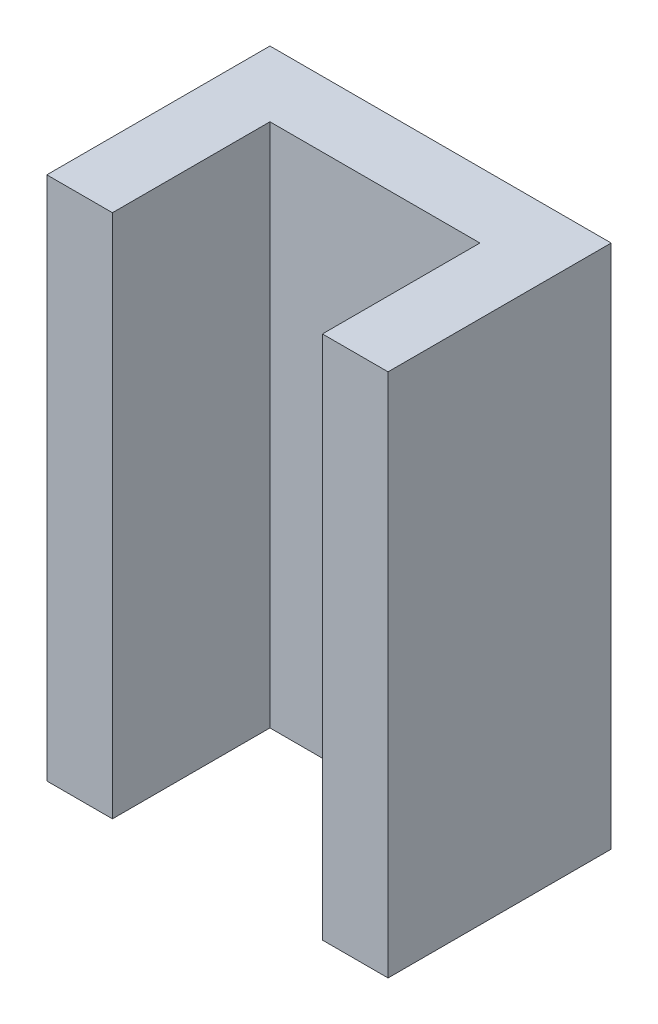
ISO-10303-21;
HEADER;
FILE_DESCRIPTION(('STEP AP214'),'2;1');
FILE_NAME('part.step','',(''),(''),'','','');
FILE_SCHEMA(('AUTOMOTIVE_DESIGN { 1 0 10303 214 1 1 1 1 }'));
ENDSEC;
DATA;
#1=APPLICATION_CONTEXT('core data for automotive mechanical design processes');
#2=APPLICATION_PROTOCOL_DEFINITION('international standard','automotive_design',2000,#1);
#3=PRODUCT_CONTEXT('',#1,'mechanical');
#4=PRODUCT('Part','Part','',(#3));
#5=PRODUCT_RELATED_PRODUCT_CATEGORY('part','',(#4));
#6=PRODUCT_DEFINITION_FORMATION('','',#4);
#7=PRODUCT_DEFINITION_CONTEXT('part definition',#1,'design');
#8=PRODUCT_DEFINITION('design','',#6,#7);
#9=PRODUCT_DEFINITION_SHAPE('','',#8);
#10=(LENGTH_UNIT() NAMED_UNIT(*) SI_UNIT(.MILLI.,.METRE.));
#11=(NAMED_UNIT(*) PLANE_ANGLE_UNIT() SI_UNIT($,.RADIAN.));
#12=(NAMED_UNIT(*) SI_UNIT($,.STERADIAN.) SOLID_ANGLE_UNIT());
#13=UNCERTAINTY_MEASURE_WITH_UNIT(LENGTH_MEASURE(1.E-05),#10,'distance_accuracy_value','');
#14=(GEOMETRIC_REPRESENTATION_CONTEXT(3) GLOBAL_UNCERTAINTY_ASSIGNED_CONTEXT((#13)) GLOBAL_UNIT_ASSIGNED_CONTEXT((#10,
#11,#12)) REPRESENTATION_CONTEXT('',''));
#15=CARTESIAN_POINT('',(0.,0.,0.));
#16=DIRECTION('',(0.,0.,1.));
#17=DIRECTION('',(1.,0.,0.));
#18=AXIS2_PLACEMENT_3D('',#15,#16,#17);
#19=CARTESIAN_POINT('',(0.,20.,0.));
#20=DIRECTION('',(0.,0.,-1.));
#21=DIRECTION('',(-1.,0.,0.));
#22=AXIS2_PLACEMENT_3D('',#19,#20,#21);
#23=PLANE('',#22);
#24=DIRECTION('',(1.,0.,0.));
#25=VECTOR('',#24,1.);
#26=CARTESIAN_POINT('',(0.,0.,0.));
#27=LINE('',#26,#25);
#28=CARTESIAN_POINT('',(0.,0.,0.));
#29=VERTEX_POINT('',#28);
#30=CARTESIAN_POINT('',(2.5,0.,0.));
#31=VERTEX_POINT('',#30);
#32=EDGE_CURVE('E129',#29,#31,#27,.T.);
#33=ORIENTED_EDGE('',*,*,#32,.T.);
#34=DIRECTION('',(0.,-1.,0.));
#35=VECTOR('',#34,1.);
#36=CARTESIAN_POINT('',(2.5,20.,0.));
#37=LINE('',#36,#35);
#38=CARTESIAN_POINT('',(2.5,20.,0.));
#39=VERTEX_POINT('',#38);
#40=EDGE_CURVE('E11',#39,#31,#37,.T.);
#41=ORIENTED_EDGE('',*,*,#40,.F.);
#42=DIRECTION('',(1.,0.,0.));
#43=VECTOR('',#42,1.);
#44=CARTESIAN_POINT('',(0.,20.,0.));
#45=LINE('',#44,#43);
#46=CARTESIAN_POINT('',(0.,20.,0.));
#47=VERTEX_POINT('',#46);
#48=EDGE_CURVE('E143',#47,#39,#45,.T.);
#49=ORIENTED_EDGE('',*,*,#48,.F.);
#50=DIRECTION('',(0.,-1.,0.));
#51=VECTOR('',#50,1.);
#52=CARTESIAN_POINT('',(0.,20.,0.));
#53=LINE('',#52,#51);
#54=EDGE_CURVE('E125',#47,#29,#53,.T.);
#55=ORIENTED_EDGE('',*,*,#54,.T.);
#56=EDGE_LOOP('',(#33,#41,#49,#55));
#57=FACE_BOUND('',#56,.T.);
#58=ADVANCED_FACE('F33',(#57),#23,.F.);
#59=CARTESIAN_POINT('',(2.5,20.,0.));
#60=DIRECTION('',(-1.,0.,0.));
#61=DIRECTION('',(0.,0.,1.));
#62=AXIS2_PLACEMENT_3D('',#59,#60,#61);
#63=PLANE('',#62);
#64=DIRECTION('',(0.,0.,-1.));
#65=VECTOR('',#64,1.);
#66=CARTESIAN_POINT('',(2.5,0.,0.));
#67=LINE('',#66,#65);
#68=CARTESIAN_POINT('',(2.5,0.,-6.));
#69=VERTEX_POINT('',#68);
#70=EDGE_CURVE('E132',#31,#69,#67,.T.);
#71=ORIENTED_EDGE('',*,*,#70,.T.);
#72=DIRECTION('',(0.,-1.,0.));
#73=VECTOR('',#72,1.);
#74=CARTESIAN_POINT('',(2.5,20.,-6.));
#75=LINE('',#74,#73);
#76=CARTESIAN_POINT('',(2.5,20.,-6.));
#77=VERTEX_POINT('',#76);
#78=EDGE_CURVE('E41',#77,#69,#75,.T.);
#79=ORIENTED_EDGE('',*,*,#78,.F.);
#80=DIRECTION('',(0.,0.,-1.));
#81=VECTOR('',#80,1.);
#82=CARTESIAN_POINT('',(2.5,20.,0.));
#83=LINE('',#82,#81);
#84=EDGE_CURVE('E92',#39,#77,#83,.T.);
#85=ORIENTED_EDGE('',*,*,#84,.F.);
#86=ORIENTED_EDGE('',*,*,#40,.T.);
#87=EDGE_LOOP('',(#71,#79,#85,#86));
#88=FACE_BOUND('',#87,.T.);
#89=ADVANCED_FACE('F178',(#88),#63,.F.);
#90=CARTESIAN_POINT('',(2.5,20.,-6.));
#91=DIRECTION('',(0.,0.,-1.));
#92=DIRECTION('',(-1.,0.,0.));
#93=AXIS2_PLACEMENT_3D('',#90,#91,#92);
#94=PLANE('',#93);
#95=DIRECTION('',(1.,0.,0.));
#96=VECTOR('',#95,1.);
#97=CARTESIAN_POINT('',(2.5,0.,-6.));
#98=LINE('',#97,#96);
#99=CARTESIAN_POINT('',(10.5,0.,-6.));
#100=VERTEX_POINT('',#99);
#101=EDGE_CURVE('E134',#69,#100,#98,.T.);
#102=ORIENTED_EDGE('',*,*,#101,.T.);
#103=DIRECTION('',(0.,-1.,0.));
#104=VECTOR('',#103,1.);
#105=CARTESIAN_POINT('',(10.5,20.,-6.));
#106=LINE('',#105,#104);
#107=CARTESIAN_POINT('',(10.5,20.,-6.));
#108=VERTEX_POINT('',#107);
#109=EDGE_CURVE('E150',#108,#100,#106,.T.);
#110=ORIENTED_EDGE('',*,*,#109,.F.);
#111=DIRECTION('',(1.,0.,0.));
#112=VECTOR('',#111,1.);
#113=CARTESIAN_POINT('',(2.5,20.,-6.));
#114=LINE('',#113,#112);
#115=EDGE_CURVE('E158',#77,#108,#114,.T.);
#116=ORIENTED_EDGE('',*,*,#115,.F.);
#117=ORIENTED_EDGE('',*,*,#78,.T.);
#118=EDGE_LOOP('',(#102,#110,#116,#117));
#119=FACE_BOUND('',#118,.T.);
#120=ADVANCED_FACE('F156',(#119),#94,.F.);
#121=CARTESIAN_POINT('',(10.5,20.,-6.));
#122=DIRECTION('',(1.,0.,0.));
#123=DIRECTION('',(0.,0.,-1.));
#124=AXIS2_PLACEMENT_3D('',#121,#122,#123);
#125=PLANE('',#124);
#126=DIRECTION('',(0.,0.,1.));
#127=VECTOR('',#126,1.);
#128=CARTESIAN_POINT('',(10.5,0.,-6.));
#129=LINE('',#128,#127);
#130=CARTESIAN_POINT('',(10.5,0.,0.));
#131=VERTEX_POINT('',#130);
#132=EDGE_CURVE('E136',#100,#131,#129,.T.);
#133=ORIENTED_EDGE('',*,*,#132,.T.);
#134=DIRECTION('',(0.,-1.,0.));
#135=VECTOR('',#134,1.);
#136=CARTESIAN_POINT('',(10.5,20.,0.));
#137=LINE('',#136,#135);
#138=CARTESIAN_POINT('',(10.5,20.,0.));
#139=VERTEX_POINT('',#138);
#140=EDGE_CURVE('E147',#139,#131,#137,.T.);
#141=ORIENTED_EDGE('',*,*,#140,.F.);
#142=DIRECTION('',(0.,0.,1.));
#143=VECTOR('',#142,1.);
#144=CARTESIAN_POINT('',(10.5,20.,-6.));
#145=LINE('',#144,#143);
#146=EDGE_CURVE('E170',#108,#139,#145,.T.);
#147=ORIENTED_EDGE('',*,*,#146,.F.);
#148=ORIENTED_EDGE('',*,*,#109,.T.);
#149=EDGE_LOOP('',(#133,#141,#147,#148));
#150=FACE_BOUND('',#149,.T.);
#151=ADVANCED_FACE('F166',(#150),#125,.F.);
#152=CARTESIAN_POINT('',(10.5,20.,0.));
#153=DIRECTION('',(0.,0.,-1.));
#154=DIRECTION('',(-1.,0.,0.));
#155=AXIS2_PLACEMENT_3D('',#152,#153,#154);
#156=PLANE('',#155);
#157=DIRECTION('',(1.,0.,0.));
#158=VECTOR('',#157,1.);
#159=CARTESIAN_POINT('',(10.5,0.,0.));
#160=LINE('',#159,#158);
#161=CARTESIAN_POINT('',(13.,0.,0.));
#162=VERTEX_POINT('',#161);
#163=EDGE_CURVE('E138',#131,#162,#160,.T.);
#164=ORIENTED_EDGE('',*,*,#163,.T.);
#165=DIRECTION('',(0.,-1.,0.));
#166=VECTOR('',#165,1.);
#167=CARTESIAN_POINT('',(13.,20.,0.));
#168=LINE('',#167,#166);
#169=CARTESIAN_POINT('',(13.,20.,0.));
#170=VERTEX_POINT('',#169);
#171=EDGE_CURVE('E120',#170,#162,#168,.T.);
#172=ORIENTED_EDGE('',*,*,#171,.F.);
#173=DIRECTION('',(1.,0.,0.));
#174=VECTOR('',#173,1.);
#175=CARTESIAN_POINT('',(10.5,20.,0.));
#176=LINE('',#175,#174);
#177=EDGE_CURVE('E111',#139,#170,#176,.T.);
#178=ORIENTED_EDGE('',*,*,#177,.F.);
#179=ORIENTED_EDGE('',*,*,#140,.T.);
#180=EDGE_LOOP('',(#164,#172,#178,#179));
#181=FACE_BOUND('',#180,.T.);
#182=ADVANCED_FACE('F169',(#181),#156,.F.);
#183=CARTESIAN_POINT('',(13.,20.,-8.5));
#184=DIRECTION('',(-1.,0.,0.));
#185=DIRECTION('',(0.,0.,1.));
#186=AXIS2_PLACEMENT_3D('',#183,#184,#185);
#187=PLANE('',#186);
#188=DIRECTION('',(0.,0.,-1.));
#189=VECTOR('',#188,1.);
#190=CARTESIAN_POINT('',(13.,0.,-8.5));
#191=LINE('',#190,#189);
#192=CARTESIAN_POINT('',(13.,0.,-8.5));
#193=VERTEX_POINT('',#192);
#194=EDGE_CURVE('E119',#162,#193,#191,.T.);
#195=ORIENTED_EDGE('',*,*,#194,.T.);
#196=DIRECTION('',(0.,-1.,0.));
#197=VECTOR('',#196,1.);
#198=CARTESIAN_POINT('',(13.,20.,-8.5));
#199=LINE('',#198,#197);
#200=CARTESIAN_POINT('',(13.,20.,-8.5));
#201=VERTEX_POINT('',#200);
#202=EDGE_CURVE('E116',#201,#193,#199,.T.);
#203=ORIENTED_EDGE('',*,*,#202,.F.);
#204=DIRECTION('',(0.,0.,-1.));
#205=VECTOR('',#204,1.);
#206=CARTESIAN_POINT('',(13.,20.,-8.5));
#207=LINE('',#206,#205);
#208=EDGE_CURVE('E105',#170,#201,#207,.T.);
#209=ORIENTED_EDGE('',*,*,#208,.F.);
#210=ORIENTED_EDGE('',*,*,#171,.T.);
#211=EDGE_LOOP('',(#195,#203,#209,#210));
#212=FACE_BOUND('',#211,.T.);
#213=ADVANCED_FACE('F117',(#212),#187,.F.);
#214=CARTESIAN_POINT('',(13.,20.,-8.5));
#215=DIRECTION('',(0.,0.,1.));
#216=DIRECTION('',(1.,0.,0.));
#217=AXIS2_PLACEMENT_3D('',#214,#215,#216);
#218=PLANE('',#217);
#219=DIRECTION('',(-1.,0.,0.));
#220=VECTOR('',#219,1.);
#221=CARTESIAN_POINT('',(13.,0.,-8.5));
#222=LINE('',#221,#220);
#223=CARTESIAN_POINT('',(0.,0.,-8.5));
#224=VERTEX_POINT('',#223);
#225=EDGE_CURVE('E78',#193,#224,#222,.T.);
#226=ORIENTED_EDGE('',*,*,#225,.T.);
#227=DIRECTION('',(0.,-1.,0.));
#228=VECTOR('',#227,1.);
#229=CARTESIAN_POINT('',(0.,20.,-8.5));
#230=LINE('',#229,#228);
#231=CARTESIAN_POINT('',(0.,20.,-8.5));
#232=VERTEX_POINT('',#231);
#233=EDGE_CURVE('E121',#232,#224,#230,.T.);
#234=ORIENTED_EDGE('',*,*,#233,.F.);
#235=DIRECTION('',(-1.,0.,0.));
#236=VECTOR('',#235,1.);
#237=CARTESIAN_POINT('',(13.,20.,-8.5));
#238=LINE('',#237,#236);
#239=EDGE_CURVE('E109',#201,#232,#238,.T.);
#240=ORIENTED_EDGE('',*,*,#239,.F.);
#241=ORIENTED_EDGE('',*,*,#202,.T.);
#242=EDGE_LOOP('',(#226,#234,#240,#241));
#243=FACE_BOUND('',#242,.T.);
#244=ADVANCED_FACE('F123',(#243),#218,.F.);
#245=CARTESIAN_POINT('',(0.,20.,0.));
#246=DIRECTION('',(1.,0.,0.));
#247=DIRECTION('',(0.,0.,-1.));
#248=AXIS2_PLACEMENT_3D('',#245,#246,#247);
#249=PLANE('',#248);
#250=DIRECTION('',(0.,0.,1.));
#251=VECTOR('',#250,1.);
#252=CARTESIAN_POINT('',(0.,0.,0.));
#253=LINE('',#252,#251);
#254=EDGE_CURVE('E84',#224,#29,#253,.T.);
#255=ORIENTED_EDGE('',*,*,#254,.T.);
#256=ORIENTED_EDGE('',*,*,#54,.F.);
#257=DIRECTION('',(0.,0.,1.));
#258=VECTOR('',#257,1.);
#259=CARTESIAN_POINT('',(0.,20.,0.));
#260=LINE('',#259,#258);
#261=EDGE_CURVE('E49',#232,#47,#260,.T.);
#262=ORIENTED_EDGE('',*,*,#261,.F.);
#263=ORIENTED_EDGE('',*,*,#233,.T.);
#264=EDGE_LOOP('',(#255,#256,#262,#263));
#265=FACE_BOUND('',#264,.T.);
#266=ADVANCED_FACE('F194',(#265),#249,.F.);
#267=CARTESIAN_POINT('',(0.,20.,0.));
#268=DIRECTION('',(0.,1.,0.));
#269=DIRECTION('',(0.,0.,1.));
#270=AXIS2_PLACEMENT_3D('',#267,#268,#269);
#271=PLANE('',#270);
#272=ORIENTED_EDGE('',*,*,#48,.T.);
#273=ORIENTED_EDGE('',*,*,#84,.T.);
#274=ORIENTED_EDGE('',*,*,#115,.T.);
#275=ORIENTED_EDGE('',*,*,#146,.T.);
#276=ORIENTED_EDGE('',*,*,#177,.T.);
#277=ORIENTED_EDGE('',*,*,#208,.T.);
#278=ORIENTED_EDGE('',*,*,#239,.T.);
#279=ORIENTED_EDGE('',*,*,#261,.T.);
#280=EDGE_LOOP('',(#272,#273,#274,#275,#276,#277,#278,#279));
#281=FACE_BOUND('',#280,.T.);
#282=ADVANCED_FACE('F107',(#281),#271,.T.);
#283=CARTESIAN_POINT('',(0.,0.,0.));
#284=DIRECTION('',(0.,1.,0.));
#285=DIRECTION('',(0.,0.,1.));
#286=AXIS2_PLACEMENT_3D('',#283,#284,#285);
#287=PLANE('',#286);
#288=ORIENTED_EDGE('',*,*,#32,.F.);
#289=ORIENTED_EDGE('',*,*,#254,.F.);
#290=ORIENTED_EDGE('',*,*,#225,.F.);
#291=ORIENTED_EDGE('',*,*,#194,.F.);
#292=ORIENTED_EDGE('',*,*,#163,.F.);
#293=ORIENTED_EDGE('',*,*,#132,.F.);
#294=ORIENTED_EDGE('',*,*,#101,.F.);
#295=ORIENTED_EDGE('',*,*,#70,.F.);
#296=EDGE_LOOP('',(#288,#289,#290,#291,#292,#293,#294,#295));
#297=FACE_BOUND('',#296,.T.);
#298=ADVANCED_FACE('F162',(#297),#287,.F.);
#299=CLOSED_SHELL('',(#58,#89,#120,#151,#182,#213,#244,#266,#282,#298));
#300=MANIFOLD_SOLID_BREP('B2',#299);
#301=ADVANCED_BREP_SHAPE_REPRESENTATION('',(#18,#300),#14);
#302=SHAPE_DEFINITION_REPRESENTATION(#9,#301);
ENDSEC;
END-ISO-10303-21;
